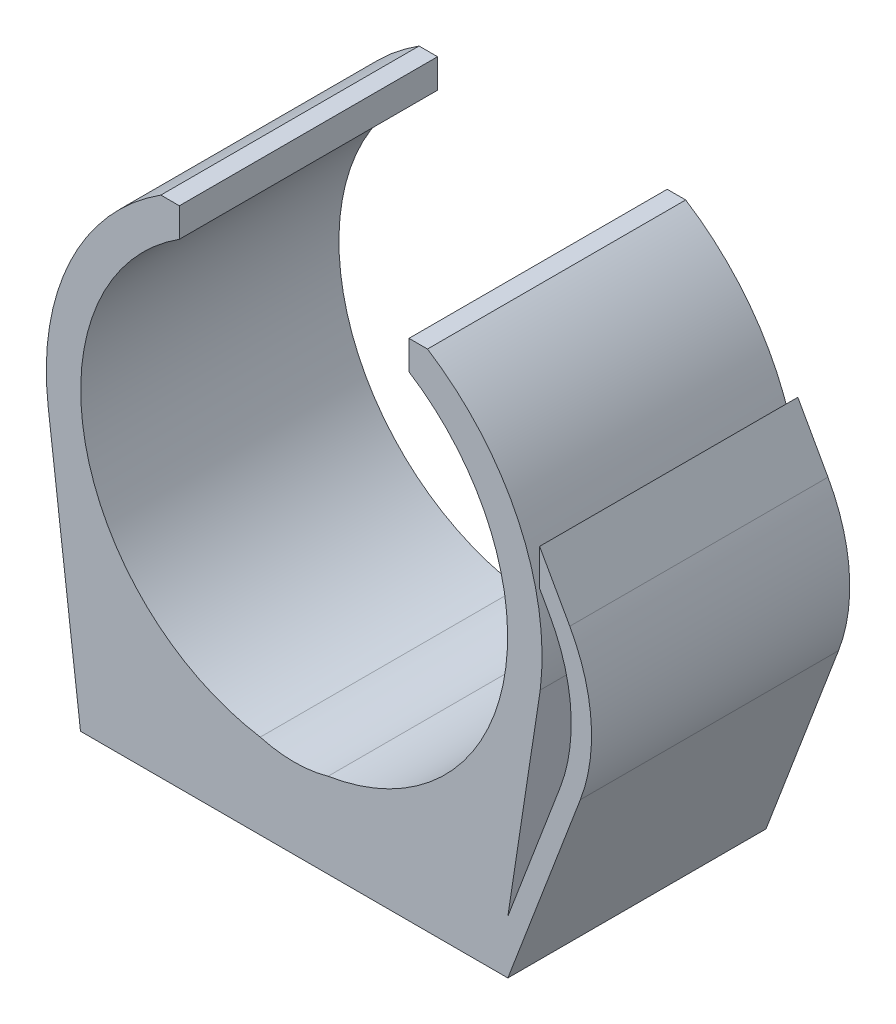
ISO-10303-21;
HEADER;
FILE_DESCRIPTION(('STEP AP214'),'2;1');
FILE_NAME('part.step','',(''),(''),'','','');
FILE_SCHEMA(('AUTOMOTIVE_DESIGN { 1 0 10303 214 1 1 1 1 }'));
ENDSEC;
DATA;
#1=APPLICATION_CONTEXT('core data for automotive mechanical design processes');
#2=APPLICATION_PROTOCOL_DEFINITION('international standard','automotive_design',2000,#1);
#3=PRODUCT_CONTEXT('',#1,'mechanical');
#4=PRODUCT('Part','Part','',(#3));
#5=PRODUCT_RELATED_PRODUCT_CATEGORY('part','',(#4));
#6=PRODUCT_DEFINITION_FORMATION('','',#4);
#7=PRODUCT_DEFINITION_CONTEXT('part definition',#1,'design');
#8=PRODUCT_DEFINITION('design','',#6,#7);
#9=PRODUCT_DEFINITION_SHAPE('','',#8);
#10=(LENGTH_UNIT() NAMED_UNIT(*) SI_UNIT(.MILLI.,.METRE.));
#11=(NAMED_UNIT(*) PLANE_ANGLE_UNIT() SI_UNIT($,.RADIAN.));
#12=(NAMED_UNIT(*) SI_UNIT($,.STERADIAN.) SOLID_ANGLE_UNIT());
#13=UNCERTAINTY_MEASURE_WITH_UNIT(LENGTH_MEASURE(1.E-05),#10,'distance_accuracy_value','');
#14=(GEOMETRIC_REPRESENTATION_CONTEXT(3) GLOBAL_UNCERTAINTY_ASSIGNED_CONTEXT((#13)) GLOBAL_UNIT_ASSIGNED_CONTEXT((#10,
#11,#12)) REPRESENTATION_CONTEXT('',''));
#15=CARTESIAN_POINT('',(0.,0.,0.));
#16=DIRECTION('',(0.,0.,1.));
#17=DIRECTION('',(1.,0.,0.));
#18=AXIS2_PLACEMENT_3D('',#15,#16,#17);
#19=CARTESIAN_POINT('',(0.,0.,15.));
#20=DIRECTION('',(0.,0.,-1.));
#21=DIRECTION('',(-1.,0.,0.));
#22=AXIS2_PLACEMENT_3D('',#19,#20,#21);
#23=CYLINDRICAL_SURFACE('',#22,14.4);
#24=CARTESIAN_POINT('',(0.,0.,0.));
#25=DIRECTION('',(0.,0.,1.));
#26=DIRECTION('',(1.,0.,0.));
#27=AXIS2_PLACEMENT_3D('',#24,#25,#26);
#28=CIRCLE('',#27,14.4);
#29=CARTESIAN_POINT('',(-7.74523723955956,12.1396581542867,0.));
#30=VERTEX_POINT('',#29);
#31=CARTESIAN_POINT('',(-14.2941545573588,-1.74274079838045,0.));
#32=VERTEX_POINT('',#31);
#33=EDGE_CURVE('E188',#30,#32,#28,.T.);
#34=ORIENTED_EDGE('',*,*,#33,.T.);
#35=DIRECTION('',(0.,0.,-1.));
#36=VECTOR('',#35,1.);
#37=CARTESIAN_POINT('',(-14.2941545573588,-1.74274079838045,15.));
#38=LINE('',#37,#36);
#39=CARTESIAN_POINT('',(-14.2941545573588,-1.74274079838045,15.));
#40=VERTEX_POINT('',#39);
#41=EDGE_CURVE('E169',#40,#32,#38,.T.);
#42=ORIENTED_EDGE('',*,*,#41,.F.);
#43=CARTESIAN_POINT('',(0.,0.,15.));
#44=DIRECTION('',(0.,0.,1.));
#45=DIRECTION('',(1.,0.,0.));
#46=AXIS2_PLACEMENT_3D('',#43,#44,#45);
#47=CIRCLE('',#46,14.4);
#48=CARTESIAN_POINT('',(-7.74523723955956,12.1396581542867,15.));
#49=VERTEX_POINT('',#48);
#50=EDGE_CURVE('E176',#49,#40,#47,.T.);
#51=ORIENTED_EDGE('',*,*,#50,.F.);
#52=DIRECTION('',(0.,0.,-1.));
#53=VECTOR('',#52,1.);
#54=CARTESIAN_POINT('',(-7.74523723955956,12.1396581542867,15.));
#55=LINE('',#54,#53);
#56=EDGE_CURVE('E258',#49,#30,#55,.T.);
#57=ORIENTED_EDGE('',*,*,#56,.T.);
#58=EDGE_LOOP('',(#34,#42,#51,#57));
#59=FACE_BOUND('',#58,.T.);
#60=ADVANCED_FACE('F33',(#59),#23,.T.);
#61=CARTESIAN_POINT('',(-14.2941545573588,-1.74274079838045,15.));
#62=DIRECTION('',(0.992649622038803,0.121023666554198,0.));
#63=DIRECTION('',(-0.121023666554198,0.992649622038803,0.));
#64=AXIS2_PLACEMENT_3D('',#61,#62,#63);
#65=PLANE('',#64);
#66=DIRECTION('',(0.121023666554198,-0.992649622038803,0.));
#67=VECTOR('',#66,1.);
#68=CARTESIAN_POINT('',(-14.2941545573588,-1.74274079838045,0.));
#69=LINE('',#68,#67);
#70=CARTESIAN_POINT('',(-12.4131782675875,-17.1707182863144,0.));
#71=VERTEX_POINT('',#70);
#72=EDGE_CURVE('E260',#32,#71,#69,.T.);
#73=ORIENTED_EDGE('',*,*,#72,.T.);
#74=DIRECTION('',(0.,0.,-1.));
#75=VECTOR('',#74,1.);
#76=CARTESIAN_POINT('',(-12.4131782675875,-17.1707182863144,15.));
#77=LINE('',#76,#75);
#78=CARTESIAN_POINT('',(-12.4131782675875,-17.1707182863144,15.));
#79=VERTEX_POINT('',#78);
#80=EDGE_CURVE('E172',#79,#71,#77,.T.);
#81=ORIENTED_EDGE('',*,*,#80,.F.);
#82=DIRECTION('',(0.121023666554198,-0.992649622038803,0.));
#83=VECTOR('',#82,1.);
#84=CARTESIAN_POINT('',(-14.2941545573588,-1.74274079838045,15.));
#85=LINE('',#84,#83);
#86=EDGE_CURVE('E165',#40,#79,#85,.T.);
#87=ORIENTED_EDGE('',*,*,#86,.F.);
#88=ORIENTED_EDGE('',*,*,#41,.T.);
#89=EDGE_LOOP('',(#73,#81,#87,#88));
#90=FACE_BOUND('',#89,.T.);
#91=ADVANCED_FACE('F167',(#90),#65,.F.);
#92=CARTESIAN_POINT('',(-12.4131782675875,-17.1707182863144,15.));
#93=DIRECTION('',(0.,1.,0.));
#94=DIRECTION('',(0.,0.,1.));
#95=AXIS2_PLACEMENT_3D('',#92,#93,#94);
#96=PLANE('',#95);
#97=DIRECTION('',(1.,0.,0.));
#98=VECTOR('',#97,1.);
#99=CARTESIAN_POINT('',(-12.4131782675875,-17.1707182863144,0.));
#100=LINE('',#99,#98);
#101=CARTESIAN_POINT('',(12.4131782675875,-17.1707182863144,0.));
#102=VERTEX_POINT('',#101);
#103=EDGE_CURVE('E262',#71,#102,#100,.T.);
#104=ORIENTED_EDGE('',*,*,#103,.T.);
#105=DIRECTION('',(0.,0.,-1.));
#106=VECTOR('',#105,1.);
#107=CARTESIAN_POINT('',(12.4131782675875,-17.1707182863144,15.));
#108=LINE('',#107,#106);
#109=CARTESIAN_POINT('',(12.4131782675875,-17.1707182863144,15.));
#110=VERTEX_POINT('',#109);
#111=EDGE_CURVE('E194',#110,#102,#108,.T.);
#112=ORIENTED_EDGE('',*,*,#111,.F.);
#113=DIRECTION('',(1.,0.,0.));
#114=VECTOR('',#113,1.);
#115=CARTESIAN_POINT('',(-12.4131782675875,-17.1707182863144,15.));
#116=LINE('',#115,#114);
#117=EDGE_CURVE('E175',#79,#110,#116,.T.);
#118=ORIENTED_EDGE('',*,*,#117,.F.);
#119=ORIENTED_EDGE('',*,*,#80,.T.);
#120=EDGE_LOOP('',(#104,#112,#118,#119));
#121=FACE_BOUND('',#120,.T.);
#122=ADVANCED_FACE('F322',(#121),#96,.F.);
#123=CARTESIAN_POINT('',(12.4131782675875,-17.1707182863144,15.));
#124=DIRECTION('',(-0.934738730025509,0.355335765988027,0.));
#125=DIRECTION('',(-0.355335765988027,-0.934738730025509,0.));
#126=AXIS2_PLACEMENT_3D('',#123,#124,#125);
#127=PLANE('',#126);
#128=DIRECTION('',(0.355335765988027,0.934738730025509,0.));
#129=VECTOR('',#128,1.);
#130=CARTESIAN_POINT('',(12.4131782675875,-17.1707182863144,0.));
#131=LINE('',#130,#129);
#132=CARTESIAN_POINT('',(16.6232184000225,-6.0958760007187,0.));
#133=VERTEX_POINT('',#132);
#134=EDGE_CURVE('E264',#102,#133,#131,.T.);
#135=ORIENTED_EDGE('',*,*,#134,.T.);
#136=DIRECTION('',(0.,0.,-1.));
#137=VECTOR('',#136,1.);
#138=CARTESIAN_POINT('',(16.6232184000225,-6.0958760007187,15.));
#139=LINE('',#138,#137);
#140=CARTESIAN_POINT('',(16.6232184000225,-6.0958760007187,15.));
#141=VERTEX_POINT('',#140);
#142=EDGE_CURVE('E48',#133,#141,#139,.F.);
#143=ORIENTED_EDGE('',*,*,#142,.T.);
#144=DIRECTION('',(0.355335765988027,0.934738730025509,0.));
#145=VECTOR('',#144,1.);
#146=CARTESIAN_POINT('',(12.4131782675875,-17.1707182863144,15.));
#147=LINE('',#146,#145);
#148=EDGE_CURVE('E319',#110,#141,#147,.T.);
#149=ORIENTED_EDGE('',*,*,#148,.F.);
#150=ORIENTED_EDGE('',*,*,#111,.T.);
#151=EDGE_LOOP('',(#135,#143,#149,#150));
#152=FACE_BOUND('',#151,.T.);
#153=ADVANCED_FACE('F318',(#152),#127,.F.);
#154=CARTESIAN_POINT('',(18.2780387063664,-1.74274079838045,15.));
#155=DIRECTION('',(-0.873523061931228,-0.48678276497252,0.));
#156=DIRECTION('',(0.48678276497252,-0.873523061931228,0.));
#157=AXIS2_PLACEMENT_3D('',#154,#155,#156);
#158=PLANE('',#157);
#159=DIRECTION('',(-0.48678276497252,0.873523061931228,0.));
#160=VECTOR('',#159,1.);
#161=CARTESIAN_POINT('',(18.2780387063664,-1.74274079838045,15.));
#162=LINE('',#161,#160);
#163=CARTESIAN_POINT('',(16.0110617190797,2.32530930888678,15.));
#164=VERTEX_POINT('',#163);
#165=CARTESIAN_POINT('',(14.2590110673986,5.46933321450206,15.));
#166=VERTEX_POINT('',#165);
#167=EDGE_CURVE('E324',#164,#166,#162,.T.);
#168=ORIENTED_EDGE('',*,*,#167,.F.);
#169=DIRECTION('',(0.,0.,-1.));
#170=VECTOR('',#169,1.);
#171=CARTESIAN_POINT('',(16.0110617190797,2.32530930888678,15.));
#172=LINE('',#171,#170);
#173=CARTESIAN_POINT('',(16.0110617190797,2.32530930888678,0.));
#174=VERTEX_POINT('',#173);
#175=EDGE_CURVE('E199',#164,#174,#172,.T.);
#176=ORIENTED_EDGE('',*,*,#175,.T.);
#177=DIRECTION('',(-0.48678276497252,0.873523061931228,0.));
#178=VECTOR('',#177,1.);
#179=CARTESIAN_POINT('',(18.2780387063664,-1.74274079838045,0.));
#180=LINE('',#179,#178);
#181=CARTESIAN_POINT('',(14.2590110673986,5.46933321450206,0.));
#182=VERTEX_POINT('',#181);
#183=EDGE_CURVE('E266',#174,#182,#180,.T.);
#184=ORIENTED_EDGE('',*,*,#183,.T.);
#185=DIRECTION('',(0.,0.,-1.));
#186=VECTOR('',#185,1.);
#187=CARTESIAN_POINT('',(14.2590110673986,5.46933321450206,15.));
#188=LINE('',#187,#186);
#189=EDGE_CURVE('E314',#166,#182,#188,.T.);
#190=ORIENTED_EDGE('',*,*,#189,.F.);
#191=EDGE_LOOP('',(#168,#176,#184,#190));
#192=FACE_BOUND('',#191,.T.);
#193=ADVANCED_FACE('F333',(#192),#158,.F.);
#194=CARTESIAN_POINT('',(14.2590110673986,5.46933321450206,15.));
#195=DIRECTION('',(1.,0.,0.));
#196=DIRECTION('',(0.,0.,-1.));
#197=AXIS2_PLACEMENT_3D('',#194,#195,#196);
#198=PLANE('',#197);
#199=DIRECTION('',(0.,-1.,0.));
#200=VECTOR('',#199,1.);
#201=CARTESIAN_POINT('',(14.2590110673986,5.46933321450206,0.));
#202=LINE('',#201,#200);
#203=CARTESIAN_POINT('',(14.2590110673986,3.35097256592398,0.));
#204=VERTEX_POINT('',#203);
#205=EDGE_CURVE('E223',#182,#204,#202,.T.);
#206=ORIENTED_EDGE('',*,*,#205,.T.);
#207=DIRECTION('',(0.,0.,-1.));
#208=VECTOR('',#207,1.);
#209=CARTESIAN_POINT('',(14.2590110673986,3.35097256592398,15.));
#210=LINE('',#209,#208);
#211=CARTESIAN_POINT('',(14.2590110673986,3.35097256592398,15.));
#212=VERTEX_POINT('',#211);
#213=EDGE_CURVE('E222',#212,#204,#210,.T.);
#214=ORIENTED_EDGE('',*,*,#213,.F.);
#215=DIRECTION('',(0.,-1.,0.));
#216=VECTOR('',#215,1.);
#217=CARTESIAN_POINT('',(14.2590110673986,5.46933321450206,15.));
#218=LINE('',#217,#216);
#219=EDGE_CURVE('E240',#166,#212,#218,.T.);
#220=ORIENTED_EDGE('',*,*,#219,.F.);
#221=ORIENTED_EDGE('',*,*,#189,.T.);
#222=EDGE_LOOP('',(#206,#214,#220,#221));
#223=FACE_BOUND('',#222,.T.);
#224=ADVANCED_FACE('F331',(#223),#198,.F.);
#225=CARTESIAN_POINT('',(14.2590110673986,3.35097256592398,15.));
#226=DIRECTION('',(0.873523061931228,0.48678276497252,0.));
#227=DIRECTION('',(-0.48678276497252,0.873523061931228,0.));
#228=AXIS2_PLACEMENT_3D('',#225,#226,#227);
#229=PLANE('',#228);
#230=DIRECTION('',(0.48678276497252,-0.873523061931228,0.));
#231=VECTOR('',#230,1.);
#232=CARTESIAN_POINT('',(14.2590110673986,3.35097256592398,0.));
#233=LINE('',#232,#231);
#234=CARTESIAN_POINT('',(14.8305760528581,2.32530930888678,0.));
#235=VERTEX_POINT('',#234);
#236=EDGE_CURVE('E210',#204,#235,#233,.T.);
#237=ORIENTED_EDGE('',*,*,#236,.T.);
#238=DIRECTION('',(0.,0.,-1.));
#239=VECTOR('',#238,1.);
#240=CARTESIAN_POINT('',(14.8305760528581,2.32530930888678,15.));
#241=LINE('',#240,#239);
#242=CARTESIAN_POINT('',(14.8305760528581,2.32530930888678,15.));
#243=VERTEX_POINT('',#242);
#244=EDGE_CURVE('E192',#235,#243,#241,.F.);
#245=ORIENTED_EDGE('',*,*,#244,.T.);
#246=DIRECTION('',(0.48678276497252,-0.873523061931228,0.));
#247=VECTOR('',#246,1.);
#248=CARTESIAN_POINT('',(14.2590110673986,3.35097256592398,15.));
#249=LINE('',#248,#247);
#250=EDGE_CURVE('E230',#212,#243,#249,.T.);
#251=ORIENTED_EDGE('',*,*,#250,.F.);
#252=ORIENTED_EDGE('',*,*,#213,.T.);
#253=EDGE_LOOP('',(#237,#245,#251,#252));
#254=FACE_BOUND('',#253,.T.);
#255=ADVANCED_FACE('F218',(#254),#229,.F.);
#256=CARTESIAN_POINT('',(17.0975530401448,-1.74274079838045,15.));
#257=DIRECTION('',(0.934738730025509,-0.355335765988027,0.));
#258=DIRECTION('',(0.355335765988027,0.934738730025509,0.));
#259=AXIS2_PLACEMENT_3D('',#256,#257,#258);
#260=PLANE('',#259);
#261=DIRECTION('',(-0.355335765988027,-0.934738730025509,0.));
#262=VECTOR('',#261,1.);
#263=CARTESIAN_POINT('',(17.0975530401448,-1.74274079838045,15.));
#264=LINE('',#263,#262);
#265=CARTESIAN_POINT('',(15.4427327338009,-6.09587600071869,15.));
#266=VERTEX_POINT('',#265);
#267=CARTESIAN_POINT('',(12.4131782675875,-14.0653577285638,15.));
#268=VERTEX_POINT('',#267);
#269=EDGE_CURVE('E228',#266,#268,#264,.T.);
#270=ORIENTED_EDGE('',*,*,#269,.F.);
#271=DIRECTION('',(0.,0.,-1.));
#272=VECTOR('',#271,1.);
#273=CARTESIAN_POINT('',(15.4427327338009,-6.09587600071869,0.));
#274=LINE('',#273,#272);
#275=CARTESIAN_POINT('',(15.4427327338009,-6.09587600071869,0.));
#276=VERTEX_POINT('',#275);
#277=EDGE_CURVE('E189',#266,#276,#274,.T.);
#278=ORIENTED_EDGE('',*,*,#277,.T.);
#279=DIRECTION('',(-0.355335765988027,-0.934738730025509,0.));
#280=VECTOR('',#279,1.);
#281=CARTESIAN_POINT('',(17.0975530401448,-1.74274079838045,0.));
#282=LINE('',#281,#280);
#283=CARTESIAN_POINT('',(12.4131782675875,-14.0653577285638,0.));
#284=VERTEX_POINT('',#283);
#285=EDGE_CURVE('E212',#276,#284,#282,.T.);
#286=ORIENTED_EDGE('',*,*,#285,.T.);
#287=DIRECTION('',(0.,0.,-1.));
#288=VECTOR('',#287,1.);
#289=CARTESIAN_POINT('',(12.4131782675875,-14.0653577285638,15.));
#290=LINE('',#289,#288);
#291=EDGE_CURVE('E234',#268,#284,#290,.T.);
#292=ORIENTED_EDGE('',*,*,#291,.F.);
#293=EDGE_LOOP('',(#270,#278,#286,#292));
#294=FACE_BOUND('',#293,.T.);
#295=ADVANCED_FACE('F232',(#294),#260,.F.);
#296=CARTESIAN_POINT('',(12.4131782675875,-14.0653577285638,15.));
#297=DIRECTION('',(-0.988549584717065,0.150896383507748,0.));
#298=DIRECTION('',(-0.150896383507748,-0.988549584717065,0.));
#299=AXIS2_PLACEMENT_3D('',#296,#297,#298);
#300=PLANE('',#299);
#301=DIRECTION('',(0.150896383507748,0.988549584717065,0.));
#302=VECTOR('',#301,1.);
#303=CARTESIAN_POINT('',(12.4131782675875,-14.0653577285638,0.));
#304=LINE('',#303,#302);
#305=CARTESIAN_POINT('',(14.2941545573588,-1.74274079838045,0.));
#306=VERTEX_POINT('',#305);
#307=EDGE_CURVE('E270',#284,#306,#304,.T.);
#308=ORIENTED_EDGE('',*,*,#307,.T.);
#309=DIRECTION('',(0.,0.,-1.));
#310=VECTOR('',#309,1.);
#311=CARTESIAN_POINT('',(14.2941545573588,-1.74274079838045,15.));
#312=LINE('',#311,#310);
#313=CARTESIAN_POINT('',(14.2941545573588,-1.74274079838045,15.));
#314=VERTEX_POINT('',#313);
#315=EDGE_CURVE('E309',#314,#306,#312,.T.);
#316=ORIENTED_EDGE('',*,*,#315,.F.);
#317=DIRECTION('',(0.150896383507748,0.988549584717065,0.));
#318=VECTOR('',#317,1.);
#319=CARTESIAN_POINT('',(12.4131782675875,-14.0653577285638,15.));
#320=LINE('',#319,#318);
#321=EDGE_CURVE('E236',#268,#314,#320,.T.);
#322=ORIENTED_EDGE('',*,*,#321,.F.);
#323=ORIENTED_EDGE('',*,*,#291,.T.);
#324=EDGE_LOOP('',(#308,#316,#322,#323));
#325=FACE_BOUND('',#324,.T.);
#326=ADVANCED_FACE('F360',(#325),#300,.F.);
#327=CARTESIAN_POINT('',(0.,0.,15.));
#328=DIRECTION('',(0.,0.,-1.));
#329=DIRECTION('',(-1.,0.,0.));
#330=AXIS2_PLACEMENT_3D('',#327,#328,#329);
#331=CYLINDRICAL_SURFACE('',#330,14.4);
#332=CARTESIAN_POINT('',(0.,0.,0.));
#333=DIRECTION('',(0.,0.,1.));
#334=DIRECTION('',(1.,0.,0.));
#335=AXIS2_PLACEMENT_3D('',#332,#333,#334);
#336=CIRCLE('',#335,14.4);
#337=CARTESIAN_POINT('',(7.74523723955955,12.1396581542867,0.));
#338=VERTEX_POINT('',#337);
#339=EDGE_CURVE('E272',#306,#338,#336,.T.);
#340=ORIENTED_EDGE('',*,*,#339,.T.);
#341=DIRECTION('',(0.,0.,-1.));
#342=VECTOR('',#341,1.);
#343=CARTESIAN_POINT('',(7.74523723955955,12.1396581542867,15.));
#344=LINE('',#343,#342);
#345=CARTESIAN_POINT('',(7.74523723955955,12.1396581542867,15.));
#346=VERTEX_POINT('',#345);
#347=EDGE_CURVE('E306',#346,#338,#344,.T.);
#348=ORIENTED_EDGE('',*,*,#347,.F.);
#349=CARTESIAN_POINT('',(0.,0.,15.));
#350=DIRECTION('',(0.,0.,1.));
#351=DIRECTION('',(1.,0.,0.));
#352=AXIS2_PLACEMENT_3D('',#349,#350,#351);
#353=CIRCLE('',#352,14.4);
#354=EDGE_CURVE('E238',#314,#346,#353,.T.);
#355=ORIENTED_EDGE('',*,*,#354,.F.);
#356=ORIENTED_EDGE('',*,*,#315,.T.);
#357=EDGE_LOOP('',(#340,#348,#355,#356));
#358=FACE_BOUND('',#357,.T.);
#359=ADVANCED_FACE('F363',(#358),#331,.T.);
#360=CARTESIAN_POINT('',(6.66950984517628,12.1396581542867,15.));
#361=DIRECTION('',(0.,-1.,0.));
#362=DIRECTION('',(1.,0.,0.));
#363=AXIS2_PLACEMENT_3D('',#360,#361,#362);
#364=PLANE('',#363);
#365=DIRECTION('',(-1.,0.,0.));
#366=VECTOR('',#365,1.);
#367=CARTESIAN_POINT('',(6.66950984517628,12.1396581542867,0.));
#368=LINE('',#367,#366);
#369=CARTESIAN_POINT('',(6.66950984517628,12.1396581542867,0.));
#370=VERTEX_POINT('',#369);
#371=EDGE_CURVE('E274',#338,#370,#368,.T.);
#372=ORIENTED_EDGE('',*,*,#371,.T.);
#373=DIRECTION('',(0.,0.,-1.));
#374=VECTOR('',#373,1.);
#375=CARTESIAN_POINT('',(6.66950984517628,12.1396581542867,15.));
#376=LINE('',#375,#374);
#377=CARTESIAN_POINT('',(6.66950984517628,12.1396581542867,15.));
#378=VERTEX_POINT('',#377);
#379=EDGE_CURVE('E303',#378,#370,#376,.T.);
#380=ORIENTED_EDGE('',*,*,#379,.F.);
#381=DIRECTION('',(-1.,0.,0.));
#382=VECTOR('',#381,1.);
#383=CARTESIAN_POINT('',(6.66950984517628,12.1396581542867,15.));
#384=LINE('',#383,#382);
#385=EDGE_CURVE('E245',#346,#378,#384,.T.);
#386=ORIENTED_EDGE('',*,*,#385,.F.);
#387=ORIENTED_EDGE('',*,*,#347,.T.);
#388=EDGE_LOOP('',(#372,#380,#386,#387));
#389=FACE_BOUND('',#388,.T.);
#390=ADVANCED_FACE('F367',(#389),#364,.F.);
#391=CARTESIAN_POINT('',(6.66950984517628,10.4535945217469,15.));
#392=DIRECTION('',(1.,0.,0.));
#393=DIRECTION('',(0.,0.,-1.));
#394=AXIS2_PLACEMENT_3D('',#391,#392,#393);
#395=PLANE('',#394);
#396=DIRECTION('',(0.,-1.,0.));
#397=VECTOR('',#396,1.);
#398=CARTESIAN_POINT('',(6.66950984517628,10.4535945217469,0.));
#399=LINE('',#398,#397);
#400=CARTESIAN_POINT('',(6.66950984517628,10.4535945217469,0.));
#401=VERTEX_POINT('',#400);
#402=EDGE_CURVE('E276',#370,#401,#399,.T.);
#403=ORIENTED_EDGE('',*,*,#402,.T.);
#404=DIRECTION('',(0.,0.,-1.));
#405=VECTOR('',#404,1.);
#406=CARTESIAN_POINT('',(6.66950984517628,10.4535945217469,15.));
#407=LINE('',#406,#405);
#408=CARTESIAN_POINT('',(6.66950984517628,10.4535945217469,15.));
#409=VERTEX_POINT('',#408);
#410=EDGE_CURVE('E300',#409,#401,#407,.T.);
#411=ORIENTED_EDGE('',*,*,#410,.F.);
#412=DIRECTION('',(0.,-1.,0.));
#413=VECTOR('',#412,1.);
#414=CARTESIAN_POINT('',(6.66950984517628,10.4535945217469,15.));
#415=LINE('',#414,#413);
#416=EDGE_CURVE('E247',#378,#409,#415,.T.);
#417=ORIENTED_EDGE('',*,*,#416,.F.);
#418=ORIENTED_EDGE('',*,*,#379,.T.);
#419=EDGE_LOOP('',(#403,#411,#417,#418));
#420=FACE_BOUND('',#419,.T.);
#421=ADVANCED_FACE('F371',(#420),#395,.F.);
#422=CARTESIAN_POINT('',(0.,0.,15.));
#423=DIRECTION('',(0.,0.,-1.));
#424=DIRECTION('',(-1.,0.,0.));
#425=AXIS2_PLACEMENT_3D('',#422,#423,#424);
#426=CYLINDRICAL_SURFACE('',#425,12.4);
#427=CARTESIAN_POINT('',(0.,0.,0.));
#428=DIRECTION('',(0.,0.,-1.));
#429=DIRECTION('',(1.,0.,0.));
#430=AXIS2_PLACEMENT_3D('',#427,#428,#429);
#431=CIRCLE('',#430,12.4);
#432=CARTESIAN_POINT('',(1.96975473473745,-12.242551461398,0.));
#433=VERTEX_POINT('',#432);
#434=EDGE_CURVE('E278',#401,#433,#431,.T.);
#435=ORIENTED_EDGE('',*,*,#434,.T.);
#436=DIRECTION('',(0.,0.,-1.));
#437=VECTOR('',#436,1.);
#438=CARTESIAN_POINT('',(1.96975473473745,-12.242551461398,15.));
#439=LINE('',#438,#437);
#440=CARTESIAN_POINT('',(1.96975473473745,-12.242551461398,15.));
#441=VERTEX_POINT('',#440);
#442=EDGE_CURVE('E297',#441,#433,#439,.T.);
#443=ORIENTED_EDGE('',*,*,#442,.F.);
#444=CARTESIAN_POINT('',(0.,0.,15.));
#445=DIRECTION('',(0.,0.,-1.));
#446=DIRECTION('',(1.,0.,0.));
#447=AXIS2_PLACEMENT_3D('',#444,#445,#446);
#448=CIRCLE('',#447,12.4);
#449=EDGE_CURVE('E249',#409,#441,#448,.T.);
#450=ORIENTED_EDGE('',*,*,#449,.F.);
#451=ORIENTED_EDGE('',*,*,#410,.T.);
#452=EDGE_LOOP('',(#435,#443,#450,#451));
#453=FACE_BOUND('',#452,.T.);
#454=ADVANCED_FACE('F375',(#453),#426,.F.);
#455=CARTESIAN_POINT('',(0.,-5.2714744802324,15.));
#456=DIRECTION('',(0.,0.,-1.));
#457=DIRECTION('',(-1.,0.,0.));
#458=AXIS2_PLACEMENT_3D('',#455,#456,#457);
#459=CYLINDRICAL_SURFACE('',#458,7.24402153450403);
#460=CARTESIAN_POINT('',(0.,-5.2714744802324,0.));
#461=DIRECTION('',(0.,0.,-1.));
#462=DIRECTION('',(1.,0.,0.));
#463=AXIS2_PLACEMENT_3D('',#460,#461,#462);
#464=CIRCLE('',#463,7.24402153450403);
#465=CARTESIAN_POINT('',(-1.96975473473745,-12.242551461398,0.));
#466=VERTEX_POINT('',#465);
#467=EDGE_CURVE('E280',#433,#466,#464,.T.);
#468=ORIENTED_EDGE('',*,*,#467,.T.);
#469=DIRECTION('',(0.,0.,-1.));
#470=VECTOR('',#469,1.);
#471=CARTESIAN_POINT('',(-1.96975473473745,-12.242551461398,15.));
#472=LINE('',#471,#470);
#473=CARTESIAN_POINT('',(-1.96975473473745,-12.242551461398,15.));
#474=VERTEX_POINT('',#473);
#475=EDGE_CURVE('E294',#474,#466,#472,.T.);
#476=ORIENTED_EDGE('',*,*,#475,.F.);
#477=CARTESIAN_POINT('',(0.,-5.2714744802324,15.));
#478=DIRECTION('',(0.,0.,-1.));
#479=DIRECTION('',(1.,0.,0.));
#480=AXIS2_PLACEMENT_3D('',#477,#478,#479);
#481=CIRCLE('',#480,7.24402153450403);
#482=EDGE_CURVE('E251',#441,#474,#481,.T.);
#483=ORIENTED_EDGE('',*,*,#482,.F.);
#484=ORIENTED_EDGE('',*,*,#442,.T.);
#485=EDGE_LOOP('',(#468,#476,#483,#484));
#486=FACE_BOUND('',#485,.T.);
#487=ADVANCED_FACE('F379',(#486),#459,.F.);
#488=CARTESIAN_POINT('',(0.,0.,15.));
#489=DIRECTION('',(0.,0.,-1.));
#490=DIRECTION('',(-1.,0.,0.));
#491=AXIS2_PLACEMENT_3D('',#488,#489,#490);
#492=CYLINDRICAL_SURFACE('',#491,12.4);
#493=CARTESIAN_POINT('',(0.,0.,0.));
#494=DIRECTION('',(0.,0.,-1.));
#495=DIRECTION('',(1.,0.,0.));
#496=AXIS2_PLACEMENT_3D('',#493,#494,#495);
#497=CIRCLE('',#496,12.4);
#498=CARTESIAN_POINT('',(-6.66950984517628,10.4535945217469,0.));
#499=VERTEX_POINT('',#498);
#500=EDGE_CURVE('E282',#466,#499,#497,.T.);
#501=ORIENTED_EDGE('',*,*,#500,.T.);
#502=DIRECTION('',(0.,0.,-1.));
#503=VECTOR('',#502,1.);
#504=CARTESIAN_POINT('',(-6.66950984517628,10.4535945217469,15.));
#505=LINE('',#504,#503);
#506=CARTESIAN_POINT('',(-6.66950984517628,10.4535945217469,15.));
#507=VERTEX_POINT('',#506);
#508=EDGE_CURVE('E291',#507,#499,#505,.T.);
#509=ORIENTED_EDGE('',*,*,#508,.F.);
#510=CARTESIAN_POINT('',(0.,0.,15.));
#511=DIRECTION('',(0.,0.,-1.));
#512=DIRECTION('',(1.,0.,0.));
#513=AXIS2_PLACEMENT_3D('',#510,#511,#512);
#514=CIRCLE('',#513,12.4);
#515=EDGE_CURVE('E253',#474,#507,#514,.T.);
#516=ORIENTED_EDGE('',*,*,#515,.F.);
#517=ORIENTED_EDGE('',*,*,#475,.T.);
#518=EDGE_LOOP('',(#501,#509,#516,#517));
#519=FACE_BOUND('',#518,.T.);
#520=ADVANCED_FACE('F383',(#519),#492,.F.);
#521=CARTESIAN_POINT('',(-6.66950984517628,10.4535945217469,15.));
#522=DIRECTION('',(-1.,0.,0.));
#523=DIRECTION('',(0.,0.,1.));
#524=AXIS2_PLACEMENT_3D('',#521,#522,#523);
#525=PLANE('',#524);
#526=DIRECTION('',(0.,1.,0.));
#527=VECTOR('',#526,1.);
#528=CARTESIAN_POINT('',(-6.66950984517628,10.4535945217469,0.));
#529=LINE('',#528,#527);
#530=CARTESIAN_POINT('',(-6.66950984517628,12.1396581542867,0.));
#531=VERTEX_POINT('',#530);
#532=EDGE_CURVE('E284',#499,#531,#529,.T.);
#533=ORIENTED_EDGE('',*,*,#532,.T.);
#534=DIRECTION('',(0.,0.,-1.));
#535=VECTOR('',#534,1.);
#536=CARTESIAN_POINT('',(-6.66950984517628,12.1396581542867,15.));
#537=LINE('',#536,#535);
#538=CARTESIAN_POINT('',(-6.66950984517628,12.1396581542867,15.));
#539=VERTEX_POINT('',#538);
#540=EDGE_CURVE('E288',#539,#531,#537,.T.);
#541=ORIENTED_EDGE('',*,*,#540,.F.);
#542=DIRECTION('',(0.,1.,0.));
#543=VECTOR('',#542,1.);
#544=CARTESIAN_POINT('',(-6.66950984517628,10.4535945217469,15.));
#545=LINE('',#544,#543);
#546=EDGE_CURVE('E255',#507,#539,#545,.T.);
#547=ORIENTED_EDGE('',*,*,#546,.F.);
#548=ORIENTED_EDGE('',*,*,#508,.T.);
#549=EDGE_LOOP('',(#533,#541,#547,#548));
#550=FACE_BOUND('',#549,.T.);
#551=ADVANCED_FACE('F387',(#550),#525,.F.);
#552=CARTESIAN_POINT('',(-6.66950984517628,12.1396581542867,15.));
#553=DIRECTION('',(0.,-1.,0.));
#554=DIRECTION('',(1.,0.,0.));
#555=AXIS2_PLACEMENT_3D('',#552,#553,#554);
#556=PLANE('',#555);
#557=DIRECTION('',(-1.,0.,0.));
#558=VECTOR('',#557,1.);
#559=CARTESIAN_POINT('',(-6.66950984517628,12.1396581542867,0.));
#560=LINE('',#559,#558);
#561=EDGE_CURVE('E185',#531,#30,#560,.T.);
#562=ORIENTED_EDGE('',*,*,#561,.T.);
#563=ORIENTED_EDGE('',*,*,#56,.F.);
#564=DIRECTION('',(-1.,0.,0.));
#565=VECTOR('',#564,1.);
#566=CARTESIAN_POINT('',(-6.66950984517628,12.1396581542867,15.));
#567=LINE('',#566,#565);
#568=EDGE_CURVE('E181',#539,#49,#567,.T.);
#569=ORIENTED_EDGE('',*,*,#568,.F.);
#570=ORIENTED_EDGE('',*,*,#540,.T.);
#571=EDGE_LOOP('',(#562,#563,#569,#570));
#572=FACE_BOUND('',#571,.T.);
#573=ADVANCED_FACE('F391',(#572),#556,.F.);
#574=CARTESIAN_POINT('',(0.,0.,15.));
#575=DIRECTION('',(0.,0.,1.));
#576=DIRECTION('',(1.,0.,0.));
#577=AXIS2_PLACEMENT_3D('',#574,#575,#576);
#578=PLANE('',#577);
#579=ORIENTED_EDGE('',*,*,#148,.T.);
#580=CARTESIAN_POINT('',(7.27583109976743,-2.54251834083842,15.));
#581=DIRECTION('',(0.,0.,1.));
#582=DIRECTION('',(1.,0.,0.));
#583=AXIS2_PLACEMENT_3D('',#580,#581,#582);
#584=CIRCLE('',#583,10.);
#585=EDGE_CURVE('E204',#141,#164,#584,.T.);
#586=ORIENTED_EDGE('',*,*,#585,.T.);
#587=ORIENTED_EDGE('',*,*,#167,.T.);
#588=ORIENTED_EDGE('',*,*,#219,.T.);
#589=ORIENTED_EDGE('',*,*,#250,.T.);
#590=CARTESIAN_POINT('',(6.09534543354583,-2.54251834083842,15.));
#591=DIRECTION('',(0.,0.,1.));
#592=DIRECTION('',(1.,0.,0.));
#593=AXIS2_PLACEMENT_3D('',#590,#591,#592);
#594=CIRCLE('',#593,10.);
#595=EDGE_CURVE('E11',#243,#266,#594,.F.);
#596=ORIENTED_EDGE('',*,*,#595,.T.);
#597=ORIENTED_EDGE('',*,*,#269,.T.);
#598=ORIENTED_EDGE('',*,*,#321,.T.);
#599=ORIENTED_EDGE('',*,*,#354,.T.);
#600=ORIENTED_EDGE('',*,*,#385,.T.);
#601=ORIENTED_EDGE('',*,*,#416,.T.);
#602=ORIENTED_EDGE('',*,*,#449,.T.);
#603=ORIENTED_EDGE('',*,*,#482,.T.);
#604=ORIENTED_EDGE('',*,*,#515,.T.);
#605=ORIENTED_EDGE('',*,*,#546,.T.);
#606=ORIENTED_EDGE('',*,*,#568,.T.);
#607=ORIENTED_EDGE('',*,*,#50,.T.);
#608=ORIENTED_EDGE('',*,*,#86,.T.);
#609=ORIENTED_EDGE('',*,*,#117,.T.);
#610=EDGE_LOOP('',(#579,#586,#587,#588,#589,#596,#597,#598,#599,#600,#601,#602,#603,#604,#605,
#606,#607,#608,#609));
#611=FACE_BOUND('',#610,.T.);
#612=ADVANCED_FACE('F179',(#611),#578,.T.);
#613=CARTESIAN_POINT('',(0.,0.,0.));
#614=DIRECTION('',(0.,0.,1.));
#615=DIRECTION('',(1.,0.,0.));
#616=AXIS2_PLACEMENT_3D('',#613,#614,#615);
#617=PLANE('',#616);
#618=ORIENTED_EDGE('',*,*,#183,.F.);
#619=CARTESIAN_POINT('',(7.27583109976743,-2.54251834083842,0.));
#620=DIRECTION('',(0.,0.,1.));
#621=DIRECTION('',(1.,0.,0.));
#622=AXIS2_PLACEMENT_3D('',#619,#620,#621);
#623=CIRCLE('',#622,10.);
#624=EDGE_CURVE('E56',#174,#133,#623,.F.);
#625=ORIENTED_EDGE('',*,*,#624,.T.);
#626=ORIENTED_EDGE('',*,*,#134,.F.);
#627=ORIENTED_EDGE('',*,*,#103,.F.);
#628=ORIENTED_EDGE('',*,*,#72,.F.);
#629=ORIENTED_EDGE('',*,*,#33,.F.);
#630=ORIENTED_EDGE('',*,*,#561,.F.);
#631=ORIENTED_EDGE('',*,*,#532,.F.);
#632=ORIENTED_EDGE('',*,*,#500,.F.);
#633=ORIENTED_EDGE('',*,*,#467,.F.);
#634=ORIENTED_EDGE('',*,*,#434,.F.);
#635=ORIENTED_EDGE('',*,*,#402,.F.);
#636=ORIENTED_EDGE('',*,*,#371,.F.);
#637=ORIENTED_EDGE('',*,*,#339,.F.);
#638=ORIENTED_EDGE('',*,*,#307,.F.);
#639=ORIENTED_EDGE('',*,*,#285,.F.);
#640=CARTESIAN_POINT('',(6.09534543354583,-2.54251834083842,0.));
#641=DIRECTION('',(0.,0.,1.));
#642=DIRECTION('',(1.,0.,0.));
#643=AXIS2_PLACEMENT_3D('',#640,#641,#642);
#644=CIRCLE('',#643,10.);
#645=EDGE_CURVE('E41',#276,#235,#644,.T.);
#646=ORIENTED_EDGE('',*,*,#645,.T.);
#647=ORIENTED_EDGE('',*,*,#236,.F.);
#648=ORIENTED_EDGE('',*,*,#205,.F.);
#649=EDGE_LOOP('',(#618,#625,#626,#627,#628,#629,#630,#631,#632,#633,#634,#635,#636,#637,#638,
#639,#646,#647,#648));
#650=FACE_BOUND('',#649,.T.);
#651=ADVANCED_FACE('F208',(#650),#617,.F.);
#652=CARTESIAN_POINT('',(6.09534543354583,-2.54251834083842,15.));
#653=DIRECTION('',(0.,0.,1.));
#654=DIRECTION('',(1.,0.,0.));
#655=AXIS2_PLACEMENT_3D('',#652,#653,#654);
#656=CYLINDRICAL_SURFACE('',#655,10.);
#657=ORIENTED_EDGE('',*,*,#595,.F.);
#658=ORIENTED_EDGE('',*,*,#244,.F.);
#659=ORIENTED_EDGE('',*,*,#645,.F.);
#660=ORIENTED_EDGE('',*,*,#277,.F.);
#661=EDGE_LOOP('',(#657,#658,#659,#660));
#662=FACE_BOUND('',#661,.T.);
#663=ADVANCED_FACE('F226',(#662),#656,.F.);
#664=CARTESIAN_POINT('',(7.27583109976743,-2.54251834083842,15.));
#665=DIRECTION('',(0.,0.,-1.));
#666=DIRECTION('',(-1.,0.,0.));
#667=AXIS2_PLACEMENT_3D('',#664,#665,#666);
#668=CYLINDRICAL_SURFACE('',#667,10.);
#669=ORIENTED_EDGE('',*,*,#585,.F.);
#670=ORIENTED_EDGE('',*,*,#142,.F.);
#671=ORIENTED_EDGE('',*,*,#624,.F.);
#672=ORIENTED_EDGE('',*,*,#175,.F.);
#673=EDGE_LOOP('',(#669,#670,#671,#672));
#674=FACE_BOUND('',#673,.T.);
#675=ADVANCED_FACE('F35',(#674),#668,.T.);
#676=CLOSED_SHELL('',(#60,#91,#122,#153,#193,#224,#255,#295,#326,#359,#390,#421,#454,#487,#520,
#551,#573,#612,#651,#663,#675));
#677=MANIFOLD_SOLID_BREP('B2',#676);
#678=ADVANCED_BREP_SHAPE_REPRESENTATION('',(#18,#677),#14);
#679=SHAPE_DEFINITION_REPRESENTATION(#9,#678);
ENDSEC;
END-ISO-10303-21;
